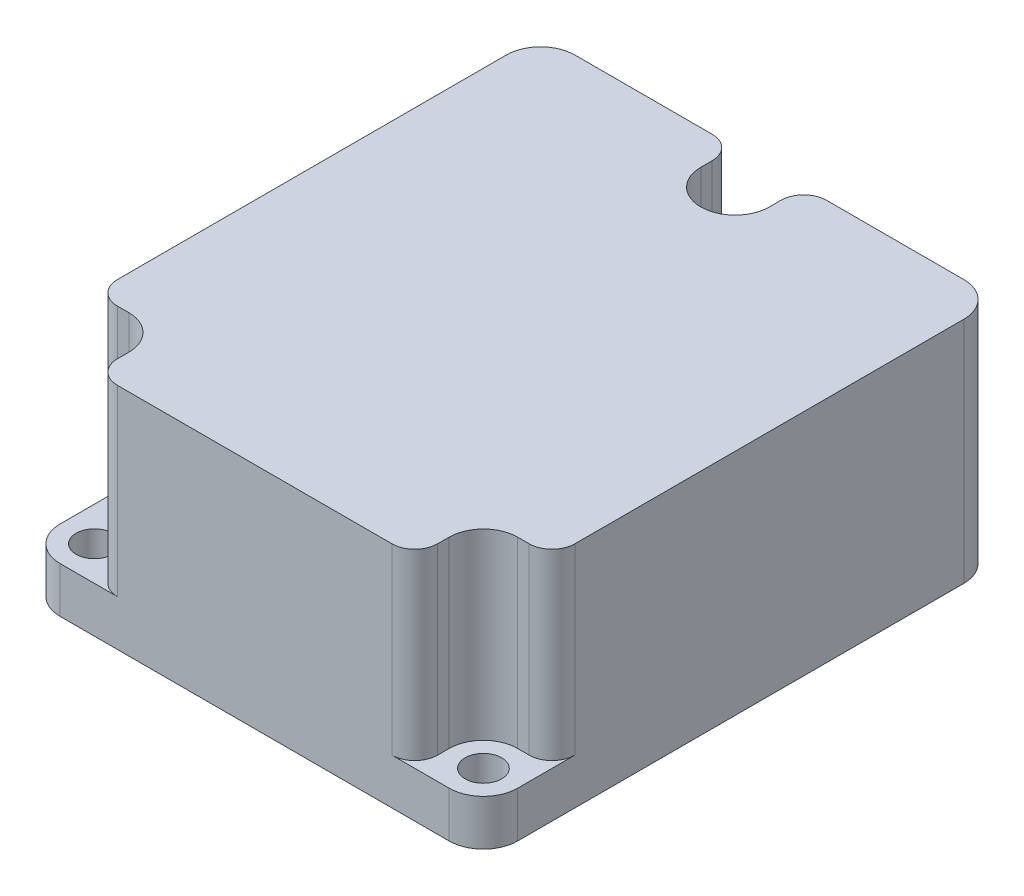
ISO-10303-21;
HEADER;
FILE_DESCRIPTION(('STEP AP214'),'2;1');
FILE_NAME('part.step','',(''),(''),'','','');
FILE_SCHEMA(('AUTOMOTIVE_DESIGN { 1 0 10303 214 1 1 1 1 }'));
ENDSEC;
DATA;
#1=APPLICATION_CONTEXT('core data for automotive mechanical design processes');
#2=APPLICATION_PROTOCOL_DEFINITION('international standard','automotive_design',2000,#1);
#3=PRODUCT_CONTEXT('',#1,'mechanical');
#4=PRODUCT('Part','Part','',(#3));
#5=PRODUCT_RELATED_PRODUCT_CATEGORY('part','',(#4));
#6=PRODUCT_DEFINITION_FORMATION('','',#4);
#7=PRODUCT_DEFINITION_CONTEXT('part definition',#1,'design');
#8=PRODUCT_DEFINITION('design','',#6,#7);
#9=PRODUCT_DEFINITION_SHAPE('','',#8);
#10=(LENGTH_UNIT() NAMED_UNIT(*) SI_UNIT(.MILLI.,.METRE.));
#11=(NAMED_UNIT(*) PLANE_ANGLE_UNIT() SI_UNIT($,.RADIAN.));
#12=(NAMED_UNIT(*) SI_UNIT($,.STERADIAN.) SOLID_ANGLE_UNIT());
#13=UNCERTAINTY_MEASURE_WITH_UNIT(LENGTH_MEASURE(1.E-05),#10,'distance_accuracy_value','');
#14=(GEOMETRIC_REPRESENTATION_CONTEXT(3) GLOBAL_UNCERTAINTY_ASSIGNED_CONTEXT((#13)) GLOBAL_UNIT_ASSIGNED_CONTEXT((#10,
#11,#12)) REPRESENTATION_CONTEXT('',''));
#15=CARTESIAN_POINT('',(0.,0.,0.));
#16=DIRECTION('',(0.,0.,1.));
#17=DIRECTION('',(1.,0.,0.));
#18=AXIS2_PLACEMENT_3D('',#15,#16,#17);
#19=CARTESIAN_POINT('',(3.00000000000001,20.,42.));
#20=DIRECTION('',(0.,1.,0.));
#21=DIRECTION('',(0.,0.,1.));
#22=AXIS2_PLACEMENT_3D('',#19,#20,#21);
#23=PLANE('',#22);
#24=DIRECTION('',(0.,0.,-1.));
#25=VECTOR('',#24,1.);
#26=CARTESIAN_POINT('',(17.,20.,0.));
#27=LINE('',#26,#25);
#28=CARTESIAN_POINT('',(17.,20.,3.));
#29=VERTEX_POINT('',#28);
#30=CARTESIAN_POINT('',(17.,20.,2.));
#31=VERTEX_POINT('',#30);
#32=EDGE_CURVE('E297',#29,#31,#27,.T.);
#33=ORIENTED_EDGE('',*,*,#32,.T.);
#34=CARTESIAN_POINT('',(15.,20.,2.));
#35=DIRECTION('',(0.,1.,0.));
#36=DIRECTION('',(0.,0.,1.));
#37=AXIS2_PLACEMENT_3D('',#34,#35,#36);
#38=CIRCLE('',#37,2.);
#39=CARTESIAN_POINT('',(15.,20.,0.));
#40=VERTEX_POINT('',#39);
#41=EDGE_CURVE('E384',#31,#40,#38,.T.);
#42=ORIENTED_EDGE('',*,*,#41,.T.);
#43=DIRECTION('',(-1.,0.,0.));
#44=VECTOR('',#43,1.);
#45=CARTESIAN_POINT('',(3.00000000000002,20.,0.));
#46=LINE('',#45,#44);
#47=CARTESIAN_POINT('',(3.00000000000002,20.,0.));
#48=VERTEX_POINT('',#47);
#49=EDGE_CURVE('E324',#40,#48,#46,.T.);
#50=ORIENTED_EDGE('',*,*,#49,.T.);
#51=CARTESIAN_POINT('',(3.,20.,3.));
#52=DIRECTION('',(0.,1.,0.));
#53=DIRECTION('',(0.,0.,1.));
#54=AXIS2_PLACEMENT_3D('',#51,#52,#53);
#55=CIRCLE('',#54,3.);
#56=CARTESIAN_POINT('',(0.,20.,3.00000000000002));
#57=VERTEX_POINT('',#56);
#58=EDGE_CURVE('E328',#48,#57,#55,.T.);
#59=ORIENTED_EDGE('',*,*,#58,.T.);
#60=DIRECTION('',(0.,0.,1.));
#61=VECTOR('',#60,1.);
#62=CARTESIAN_POINT('',(0.,20.,3.00000000000002));
#63=LINE('',#62,#61);
#64=CARTESIAN_POINT('',(0.,20.,37.));
#65=VERTEX_POINT('',#64);
#66=EDGE_CURVE('E330',#57,#65,#63,.T.);
#67=ORIENTED_EDGE('',*,*,#66,.T.);
#68=CARTESIAN_POINT('',(2.,20.,37.));
#69=DIRECTION('',(0.,1.,0.));
#70=DIRECTION('',(0.,0.,1.));
#71=AXIS2_PLACEMENT_3D('',#68,#69,#70);
#72=CIRCLE('',#71,2.);
#73=CARTESIAN_POINT('',(2.,20.,39.));
#74=VERTEX_POINT('',#73);
#75=EDGE_CURVE('E378',#65,#74,#72,.T.);
#76=ORIENTED_EDGE('',*,*,#75,.T.);
#77=DIRECTION('',(-1.,0.,0.));
#78=VECTOR('',#77,1.);
#79=CARTESIAN_POINT('',(0.,20.,39.));
#80=LINE('',#79,#78);
#81=CARTESIAN_POINT('',(3.00000000000001,20.,39.));
#82=VERTEX_POINT('',#81);
#83=EDGE_CURVE('E254',#82,#74,#80,.T.);
#84=ORIENTED_EDGE('',*,*,#83,.F.);
#85=CARTESIAN_POINT('',(3.00000000000001,20.,42.));
#86=DIRECTION('',(0.,1.,0.));
#87=DIRECTION('',(0.,0.,1.));
#88=AXIS2_PLACEMENT_3D('',#85,#86,#87);
#89=CIRCLE('',#88,3.);
#90=CARTESIAN_POINT('',(6.00000000000001,20.,42.));
#91=VERTEX_POINT('',#90);
#92=EDGE_CURVE('E273',#91,#82,#89,.T.);
#93=ORIENTED_EDGE('',*,*,#92,.F.);
#94=DIRECTION('',(0.,0.,1.));
#95=VECTOR('',#94,1.);
#96=CARTESIAN_POINT('',(6.00000000000001,20.,0.));
#97=LINE('',#96,#95);
#98=CARTESIAN_POINT('',(6.00000000000001,20.,43.));
#99=VERTEX_POINT('',#98);
#100=EDGE_CURVE('E270',#91,#99,#97,.T.);
#101=ORIENTED_EDGE('',*,*,#100,.T.);
#102=CARTESIAN_POINT('',(8.00000000000001,20.,43.));
#103=DIRECTION('',(0.,1.,0.));
#104=DIRECTION('',(0.,0.,1.));
#105=AXIS2_PLACEMENT_3D('',#102,#103,#104);
#106=CIRCLE('',#105,2.);
#107=CARTESIAN_POINT('',(8.00000000000001,20.,45.));
#108=VERTEX_POINT('',#107);
#109=EDGE_CURVE('E380',#99,#108,#106,.T.);
#110=ORIENTED_EDGE('',*,*,#109,.T.);
#111=DIRECTION('',(1.,0.,0.));
#112=VECTOR('',#111,1.);
#113=CARTESIAN_POINT('',(3.00000000000003,20.,45.));
#114=LINE('',#113,#112);
#115=CARTESIAN_POINT('',(32.,20.,45.));
#116=VERTEX_POINT('',#115);
#117=EDGE_CURVE('E316',#108,#116,#114,.T.);
#118=ORIENTED_EDGE('',*,*,#117,.T.);
#119=CARTESIAN_POINT('',(32.,20.,43.));
#120=DIRECTION('',(0.,1.,0.));
#121=DIRECTION('',(0.,0.,1.));
#122=AXIS2_PLACEMENT_3D('',#119,#120,#121);
#123=CIRCLE('',#122,2.);
#124=CARTESIAN_POINT('',(34.,20.,43.));
#125=VERTEX_POINT('',#124);
#126=EDGE_CURVE('E376',#116,#125,#123,.T.);
#127=ORIENTED_EDGE('',*,*,#126,.T.);
#128=DIRECTION('',(0.,0.,1.));
#129=VECTOR('',#128,1.);
#130=CARTESIAN_POINT('',(34.,20.,0.));
#131=LINE('',#130,#129);
#132=CARTESIAN_POINT('',(34.,20.,42.));
#133=VERTEX_POINT('',#132);
#134=EDGE_CURVE('E245',#133,#125,#131,.T.);
#135=ORIENTED_EDGE('',*,*,#134,.F.);
#136=CARTESIAN_POINT('',(37.,20.,42.));
#137=DIRECTION('',(0.,1.,0.));
#138=DIRECTION('',(0.,0.,1.));
#139=AXIS2_PLACEMENT_3D('',#136,#137,#138);
#140=CIRCLE('',#139,3.);
#141=CARTESIAN_POINT('',(37.,20.,39.));
#142=VERTEX_POINT('',#141);
#143=EDGE_CURVE('E242',#142,#133,#140,.T.);
#144=ORIENTED_EDGE('',*,*,#143,.F.);
#145=DIRECTION('',(1.,0.,0.));
#146=VECTOR('',#145,1.);
#147=CARTESIAN_POINT('',(0.,20.,39.));
#148=LINE('',#147,#146);
#149=CARTESIAN_POINT('',(38.,20.,39.));
#150=VERTEX_POINT('',#149);
#151=EDGE_CURVE('E216',#142,#150,#148,.T.);
#152=ORIENTED_EDGE('',*,*,#151,.T.);
#153=CARTESIAN_POINT('',(38.,20.,37.));
#154=DIRECTION('',(0.,1.,0.));
#155=DIRECTION('',(0.,0.,1.));
#156=AXIS2_PLACEMENT_3D('',#153,#154,#155);
#157=CIRCLE('',#156,2.);
#158=CARTESIAN_POINT('',(40.,20.,37.));
#159=VERTEX_POINT('',#158);
#160=EDGE_CURVE('E374',#150,#159,#157,.T.);
#161=ORIENTED_EDGE('',*,*,#160,.T.);
#162=DIRECTION('',(0.,0.,-1.));
#163=VECTOR('',#162,1.);
#164=CARTESIAN_POINT('',(40.,20.,3.00000000000002));
#165=LINE('',#164,#163);
#166=CARTESIAN_POINT('',(40.,20.,3.00000000000002));
#167=VERTEX_POINT('',#166);
#168=EDGE_CURVE('E319',#159,#167,#165,.T.);
#169=ORIENTED_EDGE('',*,*,#168,.T.);
#170=CARTESIAN_POINT('',(37.,20.,3.));
#171=DIRECTION('',(0.,1.,0.));
#172=DIRECTION('',(0.,0.,-1.));
#173=AXIS2_PLACEMENT_3D('',#170,#171,#172);
#174=CIRCLE('',#173,3.);
#175=CARTESIAN_POINT('',(37.,20.,0.));
#176=VERTEX_POINT('',#175);
#177=EDGE_CURVE('E322',#167,#176,#174,.T.);
#178=ORIENTED_EDGE('',*,*,#177,.T.);
#179=CARTESIAN_POINT('',(25.,20.,0.));
#180=VERTEX_POINT('',#179);
#181=EDGE_CURVE('E325',#176,#180,#46,.T.);
#182=ORIENTED_EDGE('',*,*,#181,.T.);
#183=CARTESIAN_POINT('',(25.,20.,2.));
#184=DIRECTION('',(0.,1.,0.));
#185=DIRECTION('',(0.,0.,1.));
#186=AXIS2_PLACEMENT_3D('',#183,#184,#185);
#187=CIRCLE('',#186,2.);
#188=CARTESIAN_POINT('',(23.,20.,2.));
#189=VERTEX_POINT('',#188);
#190=EDGE_CURVE('E382',#180,#189,#187,.T.);
#191=ORIENTED_EDGE('',*,*,#190,.T.);
#192=DIRECTION('',(0.,0.,-1.));
#193=VECTOR('',#192,1.);
#194=CARTESIAN_POINT('',(23.,20.,0.));
#195=LINE('',#194,#193);
#196=CARTESIAN_POINT('',(23.,20.,3.));
#197=VERTEX_POINT('',#196);
#198=EDGE_CURVE('E285',#197,#189,#195,.T.);
#199=ORIENTED_EDGE('',*,*,#198,.F.);
#200=CARTESIAN_POINT('',(20.,20.,3.));
#201=DIRECTION('',(0.,1.,0.));
#202=DIRECTION('',(0.,0.,1.));
#203=AXIS2_PLACEMENT_3D('',#200,#201,#202);
#204=CIRCLE('',#203,3.);
#205=EDGE_CURVE('E300',#29,#197,#204,.T.);
#206=ORIENTED_EDGE('',*,*,#205,.F.);
#207=EDGE_LOOP('',(#33,#42,#50,#59,#67,#76,#84,#93,#101,#110,#118,#127,#135,#144,#152,#161,#169,
#178,#182,#191,#199,#206));
#208=FACE_BOUND('',#207,.T.);
#209=ADVANCED_FACE('F40',(#208),#23,.T.);
#210=CARTESIAN_POINT('',(3.00000000000001,20.,42.));
#211=DIRECTION('',(0.,-1.,0.));
#212=DIRECTION('',(0.,0.,-1.));
#213=AXIS2_PLACEMENT_3D('',#210,#211,#212);
#214=CYLINDRICAL_SURFACE('',#213,3.);
#215=CARTESIAN_POINT('',(3.00000000000001,4.,42.));
#216=DIRECTION('',(0.,1.,0.));
#217=DIRECTION('',(0.,0.,1.));
#218=AXIS2_PLACEMENT_3D('',#215,#216,#217);
#219=CIRCLE('',#218,3.);
#220=CARTESIAN_POINT('',(0.,4.,42.));
#221=VERTEX_POINT('',#220);
#222=CARTESIAN_POINT('',(3.00000000000003,4.,45.));
#223=VERTEX_POINT('',#222);
#224=EDGE_CURVE('E265',#221,#223,#219,.T.);
#225=ORIENTED_EDGE('',*,*,#224,.F.);
#226=DIRECTION('',(0.,-1.,0.));
#227=VECTOR('',#226,1.);
#228=CARTESIAN_POINT('',(0.,20.,42.));
#229=LINE('',#228,#227);
#230=CARTESIAN_POINT('',(0.,0.,42.));
#231=VERTEX_POINT('',#230);
#232=EDGE_CURVE('E333',#221,#231,#229,.T.);
#233=ORIENTED_EDGE('',*,*,#232,.T.);
#234=CARTESIAN_POINT('',(3.00000000000001,0.,42.));
#235=DIRECTION('',(0.,1.,0.));
#236=DIRECTION('',(0.,0.,1.));
#237=AXIS2_PLACEMENT_3D('',#234,#235,#236);
#238=CIRCLE('',#237,3.);
#239=CARTESIAN_POINT('',(3.00000000000003,0.,45.));
#240=VERTEX_POINT('',#239);
#241=EDGE_CURVE('E315',#231,#240,#238,.T.);
#242=ORIENTED_EDGE('',*,*,#241,.T.);
#243=DIRECTION('',(0.,-1.,0.));
#244=VECTOR('',#243,1.);
#245=CARTESIAN_POINT('',(3.00000000000003,20.,45.));
#246=LINE('',#245,#244);
#247=EDGE_CURVE('E369',#223,#240,#246,.T.);
#248=ORIENTED_EDGE('',*,*,#247,.F.);
#249=EDGE_LOOP('',(#225,#233,#242,#248));
#250=FACE_BOUND('',#249,.T.);
#251=ADVANCED_FACE('F482',(#250),#214,.T.);
#252=CARTESIAN_POINT('',(3.00000000000003,20.,45.));
#253=DIRECTION('',(0.,0.,-1.));
#254=DIRECTION('',(-1.,0.,0.));
#255=AXIS2_PLACEMENT_3D('',#252,#253,#254);
#256=PLANE('',#255);
#257=ORIENTED_EDGE('',*,*,#117,.F.);
#258=DIRECTION('',(0.,1.,0.));
#259=VECTOR('',#258,1.);
#260=CARTESIAN_POINT('',(8.00000000000001,4.,45.));
#261=LINE('',#260,#259);
#262=CARTESIAN_POINT('',(8.00000000000001,4.,45.));
#263=VERTEX_POINT('',#262);
#264=EDGE_CURVE('E400',#108,#263,#261,.F.);
#265=ORIENTED_EDGE('',*,*,#264,.T.);
#266=DIRECTION('',(1.,0.,0.));
#267=VECTOR('',#266,1.);
#268=CARTESIAN_POINT('',(0.,4.,45.));
#269=LINE('',#268,#267);
#270=EDGE_CURVE('E267',#223,#263,#269,.T.);
#271=ORIENTED_EDGE('',*,*,#270,.F.);
#272=ORIENTED_EDGE('',*,*,#247,.T.);
#273=DIRECTION('',(1.,0.,0.));
#274=VECTOR('',#273,1.);
#275=CARTESIAN_POINT('',(3.00000000000003,0.,45.));
#276=LINE('',#275,#274);
#277=CARTESIAN_POINT('',(37.,0.,45.));
#278=VERTEX_POINT('',#277);
#279=EDGE_CURVE('E336',#240,#278,#276,.T.);
#280=ORIENTED_EDGE('',*,*,#279,.T.);
#281=DIRECTION('',(0.,-1.,0.));
#282=VECTOR('',#281,1.);
#283=CARTESIAN_POINT('',(37.,20.,45.));
#284=LINE('',#283,#282);
#285=CARTESIAN_POINT('',(37.,4.,45.));
#286=VERTEX_POINT('',#285);
#287=EDGE_CURVE('E367',#286,#278,#284,.T.);
#288=ORIENTED_EDGE('',*,*,#287,.F.);
#289=DIRECTION('',(1.,0.,0.));
#290=VECTOR('',#289,1.);
#291=CARTESIAN_POINT('',(0.,4.,45.));
#292=LINE('',#291,#290);
#293=CARTESIAN_POINT('',(32.,4.,45.));
#294=VERTEX_POINT('',#293);
#295=EDGE_CURVE('E233',#294,#286,#292,.T.);
#296=ORIENTED_EDGE('',*,*,#295,.F.);
#297=DIRECTION('',(0.,1.,0.));
#298=VECTOR('',#297,1.);
#299=CARTESIAN_POINT('',(32.,20.,45.));
#300=LINE('',#299,#298);
#301=EDGE_CURVE('E397',#294,#116,#300,.T.);
#302=ORIENTED_EDGE('',*,*,#301,.T.);
#303=EDGE_LOOP('',(#257,#265,#271,#272,#280,#288,#296,#302));
#304=FACE_BOUND('',#303,.T.);
#305=ADVANCED_FACE('F432',(#304),#256,.F.);
#306=CARTESIAN_POINT('',(37.,20.,42.));
#307=DIRECTION('',(0.,-1.,0.));
#308=DIRECTION('',(0.,0.,-1.));
#309=AXIS2_PLACEMENT_3D('',#306,#307,#308);
#310=CYLINDRICAL_SURFACE('',#309,3.);
#311=CARTESIAN_POINT('',(37.,4.,42.));
#312=DIRECTION('',(0.,1.,0.));
#313=DIRECTION('',(0.,0.,1.));
#314=AXIS2_PLACEMENT_3D('',#311,#312,#313);
#315=CIRCLE('',#314,3.);
#316=CARTESIAN_POINT('',(40.,4.,42.));
#317=VERTEX_POINT('',#316);
#318=EDGE_CURVE('E238',#286,#317,#315,.T.);
#319=ORIENTED_EDGE('',*,*,#318,.F.);
#320=ORIENTED_EDGE('',*,*,#287,.T.);
#321=CARTESIAN_POINT('',(37.,0.,42.));
#322=DIRECTION('',(0.,1.,0.));
#323=DIRECTION('',(0.,0.,1.));
#324=AXIS2_PLACEMENT_3D('',#321,#322,#323);
#325=CIRCLE('',#324,3.);
#326=CARTESIAN_POINT('',(40.,0.,42.));
#327=VERTEX_POINT('',#326);
#328=EDGE_CURVE('E339',#278,#327,#325,.T.);
#329=ORIENTED_EDGE('',*,*,#328,.T.);
#330=DIRECTION('',(0.,-1.,0.));
#331=VECTOR('',#330,1.);
#332=CARTESIAN_POINT('',(40.,20.,42.));
#333=LINE('',#332,#331);
#334=EDGE_CURVE('E365',#317,#327,#333,.T.);
#335=ORIENTED_EDGE('',*,*,#334,.F.);
#336=EDGE_LOOP('',(#319,#320,#329,#335));
#337=FACE_BOUND('',#336,.T.);
#338=ADVANCED_FACE('F488',(#337),#310,.T.);
#339=CARTESIAN_POINT('',(40.,20.,3.00000000000002));
#340=DIRECTION('',(-1.,0.,0.));
#341=DIRECTION('',(0.,0.,1.));
#342=AXIS2_PLACEMENT_3D('',#339,#340,#341);
#343=PLANE('',#342);
#344=ORIENTED_EDGE('',*,*,#168,.F.);
#345=DIRECTION('',(0.,1.,0.));
#346=VECTOR('',#345,1.);
#347=CARTESIAN_POINT('',(40.,4.,37.));
#348=LINE('',#347,#346);
#349=CARTESIAN_POINT('',(40.,4.,37.));
#350=VERTEX_POINT('',#349);
#351=EDGE_CURVE('E412',#159,#350,#348,.F.);
#352=ORIENTED_EDGE('',*,*,#351,.T.);
#353=DIRECTION('',(0.,0.,-1.));
#354=VECTOR('',#353,1.);
#355=CARTESIAN_POINT('',(40.,4.,0.));
#356=LINE('',#355,#354);
#357=EDGE_CURVE('E54',#317,#350,#356,.T.);
#358=ORIENTED_EDGE('',*,*,#357,.F.);
#359=ORIENTED_EDGE('',*,*,#334,.T.);
#360=DIRECTION('',(0.,0.,-1.));
#361=VECTOR('',#360,1.);
#362=CARTESIAN_POINT('',(40.,0.,3.00000000000002));
#363=LINE('',#362,#361);
#364=CARTESIAN_POINT('',(40.,0.,3.00000000000002));
#365=VERTEX_POINT('',#364);
#366=EDGE_CURVE('E342',#327,#365,#363,.T.);
#367=ORIENTED_EDGE('',*,*,#366,.T.);
#368=DIRECTION('',(0.,-1.,0.));
#369=VECTOR('',#368,1.);
#370=CARTESIAN_POINT('',(40.,20.,3.00000000000002));
#371=LINE('',#370,#369);
#372=EDGE_CURVE('E362',#167,#365,#371,.T.);
#373=ORIENTED_EDGE('',*,*,#372,.F.);
#374=EDGE_LOOP('',(#344,#352,#358,#359,#367,#373));
#375=FACE_BOUND('',#374,.T.);
#376=ADVANCED_FACE('F491',(#375),#343,.F.);
#377=CARTESIAN_POINT('',(3.00000000000002,20.,0.));
#378=DIRECTION('',(0.,0.,1.));
#379=DIRECTION('',(1.,0.,0.));
#380=AXIS2_PLACEMENT_3D('',#377,#378,#379);
#381=PLANE('',#380);
#382=ORIENTED_EDGE('',*,*,#49,.F.);
#383=DIRECTION('',(0.,1.,0.));
#384=VECTOR('',#383,1.);
#385=CARTESIAN_POINT('',(15.,4.,0.));
#386=LINE('',#385,#384);
#387=CARTESIAN_POINT('',(15.,4.,0.));
#388=VERTEX_POINT('',#387);
#389=EDGE_CURVE('E389',#40,#388,#386,.F.);
#390=ORIENTED_EDGE('',*,*,#389,.T.);
#391=DIRECTION('',(-1.,0.,0.));
#392=VECTOR('',#391,1.);
#393=CARTESIAN_POINT('',(0.,4.,0.));
#394=LINE('',#393,#392);
#395=CARTESIAN_POINT('',(25.,4.,0.));
#396=VERTEX_POINT('',#395);
#397=EDGE_CURVE('E294',#396,#388,#394,.T.);
#398=ORIENTED_EDGE('',*,*,#397,.F.);
#399=DIRECTION('',(0.,1.,0.));
#400=VECTOR('',#399,1.);
#401=CARTESIAN_POINT('',(25.,20.,0.));
#402=LINE('',#401,#400);
#403=EDGE_CURVE('E386',#396,#180,#402,.T.);
#404=ORIENTED_EDGE('',*,*,#403,.T.);
#405=ORIENTED_EDGE('',*,*,#181,.F.);
#406=DIRECTION('',(0.,-1.,0.));
#407=VECTOR('',#406,1.);
#408=CARTESIAN_POINT('',(37.,20.,0.));
#409=LINE('',#408,#407);
#410=CARTESIAN_POINT('',(37.,0.,0.));
#411=VERTEX_POINT('',#410);
#412=EDGE_CURVE('E359',#176,#411,#409,.T.);
#413=ORIENTED_EDGE('',*,*,#412,.T.);
#414=DIRECTION('',(-1.,0.,0.));
#415=VECTOR('',#414,1.);
#416=CARTESIAN_POINT('',(3.00000000000002,0.,0.));
#417=LINE('',#416,#415);
#418=CARTESIAN_POINT('',(3.00000000000002,0.,0.));
#419=VERTEX_POINT('',#418);
#420=EDGE_CURVE('E346',#411,#419,#417,.T.);
#421=ORIENTED_EDGE('',*,*,#420,.T.);
#422=DIRECTION('',(0.,-1.,0.));
#423=VECTOR('',#422,1.);
#424=CARTESIAN_POINT('',(3.00000000000002,20.,0.));
#425=LINE('',#424,#423);
#426=EDGE_CURVE('E356',#48,#419,#425,.T.);
#427=ORIENTED_EDGE('',*,*,#426,.F.);
#428=EDGE_LOOP('',(#382,#390,#398,#404,#405,#413,#421,#427));
#429=FACE_BOUND('',#428,.T.);
#430=ADVANCED_FACE('F524',(#429),#381,.F.);
#431=CARTESIAN_POINT('',(20.,20.,3.));
#432=DIRECTION('',(0.,-1.,0.));
#433=DIRECTION('',(0.,0.,-1.));
#434=AXIS2_PLACEMENT_3D('',#431,#432,#433);
#435=CYLINDRICAL_SURFACE('',#434,1.6);
#436=CARTESIAN_POINT('',(20.,0.,3.));
#437=DIRECTION('',(0.,1.,0.));
#438=DIRECTION('',(0.,0.,1.));
#439=AXIS2_PLACEMENT_3D('',#436,#437,#438);
#440=CIRCLE('',#439,1.6);
#441=CARTESIAN_POINT('',(20.,0.,4.6));
#442=VERTEX_POINT('',#441);
#443=EDGE_CURVE('E312',#442,#442,#440,.T.);
#444=ORIENTED_EDGE('',*,*,#443,.F.);
#445=EDGE_LOOP('',(#444));
#446=FACE_BOUND('',#445,.T.);
#447=CARTESIAN_POINT('',(20.,4.,3.));
#448=DIRECTION('',(0.,1.,0.));
#449=DIRECTION('',(0.,0.,1.));
#450=AXIS2_PLACEMENT_3D('',#447,#448,#449);
#451=CIRCLE('',#450,1.6);
#452=CARTESIAN_POINT('',(20.,4.,4.6));
#453=VERTEX_POINT('',#452);
#454=EDGE_CURVE('E281',#453,#453,#451,.F.);
#455=ORIENTED_EDGE('',*,*,#454,.F.);
#456=EDGE_LOOP('',(#455));
#457=FACE_BOUND('',#456,.T.);
#458=ADVANCED_FACE('F514',(#446,#457),#435,.F.);
#459=CARTESIAN_POINT('',(3.00000000000001,20.,42.));
#460=DIRECTION('',(0.,-1.,0.));
#461=DIRECTION('',(0.,0.,-1.));
#462=AXIS2_PLACEMENT_3D('',#459,#460,#461);
#463=CYLINDRICAL_SURFACE('',#462,1.6);
#464=CARTESIAN_POINT('',(3.00000000000001,0.,42.));
#465=DIRECTION('',(0.,1.,0.));
#466=DIRECTION('',(0.,0.,1.));
#467=AXIS2_PLACEMENT_3D('',#464,#465,#466);
#468=CIRCLE('',#467,1.6);
#469=CARTESIAN_POINT('',(3.00000000000001,0.,43.6));
#470=VERTEX_POINT('',#469);
#471=EDGE_CURVE('E309',#470,#470,#468,.T.);
#472=ORIENTED_EDGE('',*,*,#471,.F.);
#473=EDGE_LOOP('',(#472));
#474=FACE_BOUND('',#473,.T.);
#475=CARTESIAN_POINT('',(3.00000000000001,4.,42.));
#476=DIRECTION('',(0.,1.,0.));
#477=DIRECTION('',(0.,0.,1.));
#478=AXIS2_PLACEMENT_3D('',#475,#476,#477);
#479=CIRCLE('',#478,1.6);
#480=CARTESIAN_POINT('',(3.00000000000001,4.,43.6));
#481=VERTEX_POINT('',#480);
#482=EDGE_CURVE('E250',#481,#481,#479,.F.);
#483=ORIENTED_EDGE('',*,*,#482,.F.);
#484=EDGE_LOOP('',(#483));
#485=FACE_BOUND('',#484,.T.);
#486=ADVANCED_FACE('F588',(#474,#485),#463,.F.);
#487=CARTESIAN_POINT('',(37.,20.,42.));
#488=DIRECTION('',(0.,-1.,0.));
#489=DIRECTION('',(0.,0.,-1.));
#490=AXIS2_PLACEMENT_3D('',#487,#488,#489);
#491=CYLINDRICAL_SURFACE('',#490,1.6);
#492=CARTESIAN_POINT('',(37.,0.,42.));
#493=DIRECTION('',(0.,1.,0.));
#494=DIRECTION('',(0.,0.,1.));
#495=AXIS2_PLACEMENT_3D('',#492,#493,#494);
#496=CIRCLE('',#495,1.6);
#497=CARTESIAN_POINT('',(37.,0.,43.6));
#498=VERTEX_POINT('',#497);
#499=EDGE_CURVE('E248',#498,#498,#496,.T.);
#500=ORIENTED_EDGE('',*,*,#499,.F.);
#501=EDGE_LOOP('',(#500));
#502=FACE_BOUND('',#501,.T.);
#503=CARTESIAN_POINT('',(37.,4.,42.));
#504=DIRECTION('',(0.,1.,0.));
#505=DIRECTION('',(0.,0.,1.));
#506=AXIS2_PLACEMENT_3D('',#503,#504,#505);
#507=CIRCLE('',#506,1.6);
#508=CARTESIAN_POINT('',(37.,4.,43.6));
#509=VERTEX_POINT('',#508);
#510=EDGE_CURVE('E227',#509,#509,#507,.F.);
#511=ORIENTED_EDGE('',*,*,#510,.F.);
#512=EDGE_LOOP('',(#511));
#513=FACE_BOUND('',#512,.T.);
#514=ADVANCED_FACE('F519',(#502,#513),#491,.F.);
#515=CARTESIAN_POINT('',(3.00000000000001,0.,42.));
#516=DIRECTION('',(0.,1.,0.));
#517=DIRECTION('',(0.,0.,1.));
#518=AXIS2_PLACEMENT_3D('',#515,#516,#517);
#519=PLANE('',#518);
#520=ORIENTED_EDGE('',*,*,#241,.F.);
#521=DIRECTION('',(0.,0.,1.));
#522=VECTOR('',#521,1.);
#523=CARTESIAN_POINT('',(0.,0.,3.00000000000002));
#524=LINE('',#523,#522);
#525=CARTESIAN_POINT('',(0.,0.,3.00000000000002));
#526=VERTEX_POINT('',#525);
#527=EDGE_CURVE('E320',#526,#231,#524,.T.);
#528=ORIENTED_EDGE('',*,*,#527,.F.);
#529=CARTESIAN_POINT('',(3.,0.,3.));
#530=DIRECTION('',(0.,1.,0.));
#531=DIRECTION('',(0.,0.,1.));
#532=AXIS2_PLACEMENT_3D('',#529,#530,#531);
#533=CIRCLE('',#532,3.);
#534=EDGE_CURVE('E348',#419,#526,#533,.T.);
#535=ORIENTED_EDGE('',*,*,#534,.F.);
#536=ORIENTED_EDGE('',*,*,#420,.F.);
#537=CARTESIAN_POINT('',(37.,0.,3.));
#538=DIRECTION('',(0.,1.,0.));
#539=DIRECTION('',(0.,0.,-1.));
#540=AXIS2_PLACEMENT_3D('',#537,#538,#539);
#541=CIRCLE('',#540,3.);
#542=EDGE_CURVE('E344',#365,#411,#541,.T.);
#543=ORIENTED_EDGE('',*,*,#542,.F.);
#544=ORIENTED_EDGE('',*,*,#366,.F.);
#545=ORIENTED_EDGE('',*,*,#328,.F.);
#546=ORIENTED_EDGE('',*,*,#279,.F.);
#547=EDGE_LOOP('',(#520,#528,#535,#536,#543,#544,#545,#546));
#548=FACE_BOUND('',#547,.T.);
#549=ORIENTED_EDGE('',*,*,#443,.T.);
#550=EDGE_LOOP('',(#549));
#551=FACE_BOUND('',#550,.T.);
#552=ORIENTED_EDGE('',*,*,#471,.T.);
#553=EDGE_LOOP('',(#552));
#554=FACE_BOUND('',#553,.T.);
#555=ORIENTED_EDGE('',*,*,#499,.T.);
#556=EDGE_LOOP('',(#555));
#557=FACE_BOUND('',#556,.T.);
#558=ADVANCED_FACE('F474',(#548,#551,#554,#557),#519,.F.);
#559=CARTESIAN_POINT('',(37.,20.,3.));
#560=DIRECTION('',(0.,-1.,0.));
#561=DIRECTION('',(0.,0.,-1.));
#562=AXIS2_PLACEMENT_3D('',#559,#560,#561);
#563=CYLINDRICAL_SURFACE('',#562,3.);
#564=ORIENTED_EDGE('',*,*,#542,.T.);
#565=ORIENTED_EDGE('',*,*,#412,.F.);
#566=ORIENTED_EDGE('',*,*,#177,.F.);
#567=ORIENTED_EDGE('',*,*,#372,.T.);
#568=EDGE_LOOP('',(#564,#565,#566,#567));
#569=FACE_BOUND('',#568,.T.);
#570=ADVANCED_FACE('F518',(#569),#563,.T.);
#571=CARTESIAN_POINT('',(3.,20.,3.));
#572=DIRECTION('',(0.,-1.,0.));
#573=DIRECTION('',(0.,0.,-1.));
#574=AXIS2_PLACEMENT_3D('',#571,#572,#573);
#575=CYLINDRICAL_SURFACE('',#574,3.);
#576=ORIENTED_EDGE('',*,*,#534,.T.);
#577=DIRECTION('',(0.,-1.,0.));
#578=VECTOR('',#577,1.);
#579=CARTESIAN_POINT('',(0.,20.,3.00000000000002));
#580=LINE('',#579,#578);
#581=EDGE_CURVE('E353',#57,#526,#580,.T.);
#582=ORIENTED_EDGE('',*,*,#581,.F.);
#583=ORIENTED_EDGE('',*,*,#58,.F.);
#584=ORIENTED_EDGE('',*,*,#426,.T.);
#585=EDGE_LOOP('',(#576,#582,#583,#584));
#586=FACE_BOUND('',#585,.T.);
#587=ADVANCED_FACE('F469',(#586),#575,.T.);
#588=CARTESIAN_POINT('',(0.,20.,3.00000000000002));
#589=DIRECTION('',(1.,0.,0.));
#590=DIRECTION('',(0.,0.,-1.));
#591=AXIS2_PLACEMENT_3D('',#588,#589,#590);
#592=PLANE('',#591);
#593=DIRECTION('',(0.,0.,1.));
#594=VECTOR('',#593,1.);
#595=CARTESIAN_POINT('',(0.,4.,0.));
#596=LINE('',#595,#594);
#597=CARTESIAN_POINT('',(0.,4.,37.));
#598=VERTEX_POINT('',#597);
#599=EDGE_CURVE('E263',#598,#221,#596,.T.);
#600=ORIENTED_EDGE('',*,*,#599,.F.);
#601=DIRECTION('',(0.,1.,0.));
#602=VECTOR('',#601,1.);
#603=CARTESIAN_POINT('',(0.,20.,37.));
#604=LINE('',#603,#602);
#605=EDGE_CURVE('E403',#598,#65,#604,.T.);
#606=ORIENTED_EDGE('',*,*,#605,.T.);
#607=ORIENTED_EDGE('',*,*,#66,.F.);
#608=ORIENTED_EDGE('',*,*,#581,.T.);
#609=ORIENTED_EDGE('',*,*,#527,.T.);
#610=ORIENTED_EDGE('',*,*,#232,.F.);
#611=EDGE_LOOP('',(#600,#606,#607,#608,#609,#610));
#612=FACE_BOUND('',#611,.T.);
#613=ADVANCED_FACE('F462',(#612),#592,.F.);
#614=CARTESIAN_POINT('',(0.,4.,39.));
#615=DIRECTION('',(0.,0.,1.));
#616=DIRECTION('',(1.,0.,0.));
#617=AXIS2_PLACEMENT_3D('',#614,#615,#616);
#618=PLANE('',#617);
#619=DIRECTION('',(1.,0.,0.));
#620=VECTOR('',#619,1.);
#621=CARTESIAN_POINT('',(0.,4.,39.));
#622=LINE('',#621,#620);
#623=CARTESIAN_POINT('',(37.,4.,39.));
#624=VERTEX_POINT('',#623);
#625=CARTESIAN_POINT('',(38.,4.,39.));
#626=VERTEX_POINT('',#625);
#627=EDGE_CURVE('E213',#624,#626,#622,.T.);
#628=ORIENTED_EDGE('',*,*,#627,.T.);
#629=DIRECTION('',(0.,1.,0.));
#630=VECTOR('',#629,1.);
#631=CARTESIAN_POINT('',(38.,20.,39.));
#632=LINE('',#631,#630);
#633=EDGE_CURVE('E410',#626,#150,#632,.T.);
#634=ORIENTED_EDGE('',*,*,#633,.T.);
#635=ORIENTED_EDGE('',*,*,#151,.F.);
#636=DIRECTION('',(0.,1.,0.));
#637=VECTOR('',#636,1.);
#638=CARTESIAN_POINT('',(37.,4.,39.));
#639=LINE('',#638,#637);
#640=EDGE_CURVE('E210',#624,#142,#639,.T.);
#641=ORIENTED_EDGE('',*,*,#640,.F.);
#642=EDGE_LOOP('',(#628,#634,#635,#641));
#643=FACE_BOUND('',#642,.T.);
#644=ADVANCED_FACE('F211',(#643),#618,.T.);
#645=CARTESIAN_POINT('',(34.,4.,0.));
#646=DIRECTION('',(-1.,0.,0.));
#647=DIRECTION('',(0.,0.,1.));
#648=AXIS2_PLACEMENT_3D('',#645,#646,#647);
#649=PLANE('',#648);
#650=ORIENTED_EDGE('',*,*,#134,.T.);
#651=DIRECTION('',(0.,1.,0.));
#652=VECTOR('',#651,1.);
#653=CARTESIAN_POINT('',(34.,4.,43.));
#654=LINE('',#653,#652);
#655=CARTESIAN_POINT('',(34.,4.,43.));
#656=VERTEX_POINT('',#655);
#657=EDGE_CURVE('E408',#125,#656,#654,.F.);
#658=ORIENTED_EDGE('',*,*,#657,.T.);
#659=DIRECTION('',(0.,0.,1.));
#660=VECTOR('',#659,1.);
#661=CARTESIAN_POINT('',(34.,4.,0.));
#662=LINE('',#661,#660);
#663=CARTESIAN_POINT('',(34.,4.,42.));
#664=VERTEX_POINT('',#663);
#665=EDGE_CURVE('E231',#664,#656,#662,.T.);
#666=ORIENTED_EDGE('',*,*,#665,.F.);
#667=DIRECTION('',(0.,1.,0.));
#668=VECTOR('',#667,1.);
#669=CARTESIAN_POINT('',(34.,4.,42.));
#670=LINE('',#669,#668);
#671=EDGE_CURVE('E221',#664,#133,#670,.T.);
#672=ORIENTED_EDGE('',*,*,#671,.T.);
#673=EDGE_LOOP('',(#650,#658,#666,#672));
#674=FACE_BOUND('',#673,.T.);
#675=ADVANCED_FACE('F496',(#674),#649,.F.);
#676=CARTESIAN_POINT('',(37.,4.,42.));
#677=DIRECTION('',(0.,1.,0.));
#678=DIRECTION('',(0.,0.,1.));
#679=AXIS2_PLACEMENT_3D('',#676,#677,#678);
#680=CYLINDRICAL_SURFACE('',#679,3.);
#681=ORIENTED_EDGE('',*,*,#143,.T.);
#682=ORIENTED_EDGE('',*,*,#671,.F.);
#683=CARTESIAN_POINT('',(37.,4.,42.));
#684=DIRECTION('',(0.,1.,0.));
#685=DIRECTION('',(0.,0.,1.));
#686=AXIS2_PLACEMENT_3D('',#683,#684,#685);
#687=CIRCLE('',#686,3.);
#688=EDGE_CURVE('E226',#624,#664,#687,.T.);
#689=ORIENTED_EDGE('',*,*,#688,.F.);
#690=ORIENTED_EDGE('',*,*,#640,.T.);
#691=EDGE_LOOP('',(#681,#682,#689,#690));
#692=FACE_BOUND('',#691,.T.);
#693=ADVANCED_FACE('F229',(#692),#680,.F.);
#694=CARTESIAN_POINT('',(0.,4.,0.));
#695=DIRECTION('',(0.,1.,0.));
#696=DIRECTION('',(0.,0.,1.));
#697=AXIS2_PLACEMENT_3D('',#694,#695,#696);
#698=PLANE('',#697);
#699=ORIENTED_EDGE('',*,*,#510,.T.);
#700=EDGE_LOOP('',(#699));
#701=FACE_BOUND('',#700,.T.);
#702=ORIENTED_EDGE('',*,*,#627,.F.);
#703=ORIENTED_EDGE('',*,*,#688,.T.);
#704=ORIENTED_EDGE('',*,*,#665,.T.);
#705=CARTESIAN_POINT('',(32.,4.,43.));
#706=DIRECTION('',(0.,1.,0.));
#707=DIRECTION('',(0.,0.,1.));
#708=AXIS2_PLACEMENT_3D('',#705,#706,#707);
#709=CIRCLE('',#708,2.);
#710=EDGE_CURVE('E48',#656,#294,#709,.F.);
#711=ORIENTED_EDGE('',*,*,#710,.T.);
#712=ORIENTED_EDGE('',*,*,#295,.T.);
#713=ORIENTED_EDGE('',*,*,#318,.T.);
#714=ORIENTED_EDGE('',*,*,#357,.T.);
#715=CARTESIAN_POINT('',(38.,4.,37.));
#716=DIRECTION('',(0.,1.,0.));
#717=DIRECTION('',(0.,0.,1.));
#718=AXIS2_PLACEMENT_3D('',#715,#716,#717);
#719=CIRCLE('',#718,2.);
#720=EDGE_CURVE('E11',#350,#626,#719,.F.);
#721=ORIENTED_EDGE('',*,*,#720,.T.);
#722=EDGE_LOOP('',(#702,#703,#704,#711,#712,#713,#714,#721));
#723=FACE_BOUND('',#722,.T.);
#724=ADVANCED_FACE('F224',(#701,#723),#698,.T.);
#725=CARTESIAN_POINT('',(6.00000000000001,4.,0.));
#726=DIRECTION('',(-1.,0.,0.));
#727=DIRECTION('',(0.,0.,1.));
#728=AXIS2_PLACEMENT_3D('',#725,#726,#727);
#729=PLANE('',#728);
#730=DIRECTION('',(0.,0.,1.));
#731=VECTOR('',#730,1.);
#732=CARTESIAN_POINT('',(6.00000000000001,4.,0.));
#733=LINE('',#732,#731);
#734=CARTESIAN_POINT('',(6.00000000000001,4.,42.));
#735=VERTEX_POINT('',#734);
#736=CARTESIAN_POINT('',(6.00000000000001,4.,43.));
#737=VERTEX_POINT('',#736);
#738=EDGE_CURVE('E253',#735,#737,#733,.T.);
#739=ORIENTED_EDGE('',*,*,#738,.T.);
#740=DIRECTION('',(0.,1.,0.));
#741=VECTOR('',#740,1.);
#742=CARTESIAN_POINT('',(6.00000000000001,20.,43.));
#743=LINE('',#742,#741);
#744=EDGE_CURVE('E394',#737,#99,#743,.T.);
#745=ORIENTED_EDGE('',*,*,#744,.T.);
#746=ORIENTED_EDGE('',*,*,#100,.F.);
#747=DIRECTION('',(0.,1.,0.));
#748=VECTOR('',#747,1.);
#749=CARTESIAN_POINT('',(6.00000000000001,4.,42.));
#750=LINE('',#749,#748);
#751=EDGE_CURVE('E269',#735,#91,#750,.T.);
#752=ORIENTED_EDGE('',*,*,#751,.F.);
#753=EDGE_LOOP('',(#739,#745,#746,#752));
#754=FACE_BOUND('',#753,.T.);
#755=ADVANCED_FACE('F444',(#754),#729,.T.);
#756=CARTESIAN_POINT('',(0.,4.,39.));
#757=DIRECTION('',(0.,0.,-1.));
#758=DIRECTION('',(-1.,0.,0.));
#759=AXIS2_PLACEMENT_3D('',#756,#757,#758);
#760=PLANE('',#759);
#761=ORIENTED_EDGE('',*,*,#83,.T.);
#762=DIRECTION('',(0.,1.,0.));
#763=VECTOR('',#762,1.);
#764=CARTESIAN_POINT('',(2.,4.,39.));
#765=LINE('',#764,#763);
#766=CARTESIAN_POINT('',(2.,4.,39.));
#767=VERTEX_POINT('',#766);
#768=EDGE_CURVE('E406',#74,#767,#765,.F.);
#769=ORIENTED_EDGE('',*,*,#768,.T.);
#770=DIRECTION('',(-1.,0.,0.));
#771=VECTOR('',#770,1.);
#772=CARTESIAN_POINT('',(0.,4.,39.));
#773=LINE('',#772,#771);
#774=CARTESIAN_POINT('',(3.00000000000001,4.,39.));
#775=VERTEX_POINT('',#774);
#776=EDGE_CURVE('E260',#775,#767,#773,.T.);
#777=ORIENTED_EDGE('',*,*,#776,.F.);
#778=DIRECTION('',(0.,1.,0.));
#779=VECTOR('',#778,1.);
#780=CARTESIAN_POINT('',(3.00000000000001,4.,39.));
#781=LINE('',#780,#779);
#782=EDGE_CURVE('E243',#775,#82,#781,.T.);
#783=ORIENTED_EDGE('',*,*,#782,.T.);
#784=EDGE_LOOP('',(#761,#769,#777,#783));
#785=FACE_BOUND('',#784,.T.);
#786=ADVANCED_FACE('F454',(#785),#760,.F.);
#787=CARTESIAN_POINT('',(3.00000000000001,4.,42.));
#788=DIRECTION('',(0.,1.,0.));
#789=DIRECTION('',(0.,0.,1.));
#790=AXIS2_PLACEMENT_3D('',#787,#788,#789);
#791=CYLINDRICAL_SURFACE('',#790,3.);
#792=ORIENTED_EDGE('',*,*,#92,.T.);
#793=ORIENTED_EDGE('',*,*,#782,.F.);
#794=CARTESIAN_POINT('',(3.00000000000001,4.,42.));
#795=DIRECTION('',(0.,1.,0.));
#796=DIRECTION('',(0.,0.,1.));
#797=AXIS2_PLACEMENT_3D('',#794,#795,#796);
#798=CIRCLE('',#797,3.);
#799=EDGE_CURVE('E257',#735,#775,#798,.T.);
#800=ORIENTED_EDGE('',*,*,#799,.F.);
#801=ORIENTED_EDGE('',*,*,#751,.T.);
#802=EDGE_LOOP('',(#792,#793,#800,#801));
#803=FACE_BOUND('',#802,.T.);
#804=ADVANCED_FACE('F450',(#803),#791,.F.);
#805=CARTESIAN_POINT('',(0.,4.,0.));
#806=DIRECTION('',(0.,1.,0.));
#807=DIRECTION('',(0.,0.,1.));
#808=AXIS2_PLACEMENT_3D('',#805,#806,#807);
#809=PLANE('',#808);
#810=ORIENTED_EDGE('',*,*,#482,.T.);
#811=EDGE_LOOP('',(#810));
#812=FACE_BOUND('',#811,.T.);
#813=ORIENTED_EDGE('',*,*,#738,.F.);
#814=ORIENTED_EDGE('',*,*,#799,.T.);
#815=ORIENTED_EDGE('',*,*,#776,.T.);
#816=CARTESIAN_POINT('',(2.,4.,37.));
#817=DIRECTION('',(0.,1.,0.));
#818=DIRECTION('',(0.,0.,1.));
#819=AXIS2_PLACEMENT_3D('',#816,#817,#818);
#820=CIRCLE('',#819,2.);
#821=EDGE_CURVE('E421',#767,#598,#820,.F.);
#822=ORIENTED_EDGE('',*,*,#821,.T.);
#823=ORIENTED_EDGE('',*,*,#599,.T.);
#824=ORIENTED_EDGE('',*,*,#224,.T.);
#825=ORIENTED_EDGE('',*,*,#270,.T.);
#826=CARTESIAN_POINT('',(8.00000000000001,4.,43.));
#827=DIRECTION('',(0.,1.,0.));
#828=DIRECTION('',(0.,0.,1.));
#829=AXIS2_PLACEMENT_3D('',#826,#827,#828);
#830=CIRCLE('',#829,2.);
#831=EDGE_CURVE('E419',#263,#737,#830,.F.);
#832=ORIENTED_EDGE('',*,*,#831,.T.);
#833=EDGE_LOOP('',(#813,#814,#815,#822,#823,#824,#825,#832));
#834=FACE_BOUND('',#833,.T.);
#835=ADVANCED_FACE('F448',(#812,#834),#809,.T.);
#836=CARTESIAN_POINT('',(17.,4.,0.));
#837=DIRECTION('',(1.,0.,0.));
#838=DIRECTION('',(0.,0.,-1.));
#839=AXIS2_PLACEMENT_3D('',#836,#837,#838);
#840=PLANE('',#839);
#841=DIRECTION('',(0.,0.,-1.));
#842=VECTOR('',#841,1.);
#843=CARTESIAN_POINT('',(17.,4.,0.));
#844=LINE('',#843,#842);
#845=CARTESIAN_POINT('',(17.,4.,3.));
#846=VERTEX_POINT('',#845);
#847=CARTESIAN_POINT('',(17.,4.,2.));
#848=VERTEX_POINT('',#847);
#849=EDGE_CURVE('E284',#846,#848,#844,.T.);
#850=ORIENTED_EDGE('',*,*,#849,.T.);
#851=DIRECTION('',(0.,1.,0.));
#852=VECTOR('',#851,1.);
#853=CARTESIAN_POINT('',(17.,20.,2.));
#854=LINE('',#853,#852);
#855=EDGE_CURVE('E371',#848,#31,#854,.T.);
#856=ORIENTED_EDGE('',*,*,#855,.T.);
#857=ORIENTED_EDGE('',*,*,#32,.F.);
#858=DIRECTION('',(0.,1.,0.));
#859=VECTOR('',#858,1.);
#860=CARTESIAN_POINT('',(17.,4.,3.));
#861=LINE('',#860,#859);
#862=EDGE_CURVE('E296',#846,#29,#861,.T.);
#863=ORIENTED_EDGE('',*,*,#862,.F.);
#864=EDGE_LOOP('',(#850,#856,#857,#863));
#865=FACE_BOUND('',#864,.T.);
#866=ADVANCED_FACE('F663',(#865),#840,.T.);
#867=CARTESIAN_POINT('',(23.,4.,0.));
#868=DIRECTION('',(1.,0.,0.));
#869=DIRECTION('',(0.,0.,-1.));
#870=AXIS2_PLACEMENT_3D('',#867,#868,#869);
#871=PLANE('',#870);
#872=ORIENTED_EDGE('',*,*,#198,.T.);
#873=DIRECTION('',(0.,1.,0.));
#874=VECTOR('',#873,1.);
#875=CARTESIAN_POINT('',(23.,4.,2.));
#876=LINE('',#875,#874);
#877=CARTESIAN_POINT('',(23.,4.,2.));
#878=VERTEX_POINT('',#877);
#879=EDGE_CURVE('E392',#189,#878,#876,.F.);
#880=ORIENTED_EDGE('',*,*,#879,.T.);
#881=DIRECTION('',(0.,0.,-1.));
#882=VECTOR('',#881,1.);
#883=CARTESIAN_POINT('',(23.,4.,0.));
#884=LINE('',#883,#882);
#885=CARTESIAN_POINT('',(23.,4.,3.));
#886=VERTEX_POINT('',#885);
#887=EDGE_CURVE('E291',#886,#878,#884,.T.);
#888=ORIENTED_EDGE('',*,*,#887,.F.);
#889=DIRECTION('',(0.,1.,0.));
#890=VECTOR('',#889,1.);
#891=CARTESIAN_POINT('',(23.,4.,3.));
#892=LINE('',#891,#890);
#893=EDGE_CURVE('E274',#886,#197,#892,.T.);
#894=ORIENTED_EDGE('',*,*,#893,.T.);
#895=EDGE_LOOP('',(#872,#880,#888,#894));
#896=FACE_BOUND('',#895,.T.);
#897=ADVANCED_FACE('F673',(#896),#871,.F.);
#898=CARTESIAN_POINT('',(20.,4.,3.));
#899=DIRECTION('',(0.,1.,0.));
#900=DIRECTION('',(0.,0.,1.));
#901=AXIS2_PLACEMENT_3D('',#898,#899,#900);
#902=CYLINDRICAL_SURFACE('',#901,3.);
#903=ORIENTED_EDGE('',*,*,#205,.T.);
#904=ORIENTED_EDGE('',*,*,#893,.F.);
#905=CARTESIAN_POINT('',(20.,4.,3.));
#906=DIRECTION('',(0.,1.,0.));
#907=DIRECTION('',(0.,0.,1.));
#908=AXIS2_PLACEMENT_3D('',#905,#906,#907);
#909=CIRCLE('',#908,3.);
#910=EDGE_CURVE('E288',#846,#886,#909,.T.);
#911=ORIENTED_EDGE('',*,*,#910,.F.);
#912=ORIENTED_EDGE('',*,*,#862,.T.);
#913=EDGE_LOOP('',(#903,#904,#911,#912));
#914=FACE_BOUND('',#913,.T.);
#915=ADVANCED_FACE('F683',(#914),#902,.F.);
#916=CARTESIAN_POINT('',(0.,4.,0.));
#917=DIRECTION('',(0.,1.,0.));
#918=DIRECTION('',(0.,0.,1.));
#919=AXIS2_PLACEMENT_3D('',#916,#917,#918);
#920=PLANE('',#919);
#921=ORIENTED_EDGE('',*,*,#454,.T.);
#922=EDGE_LOOP('',(#921));
#923=FACE_BOUND('',#922,.T.);
#924=ORIENTED_EDGE('',*,*,#849,.F.);
#925=ORIENTED_EDGE('',*,*,#910,.T.);
#926=ORIENTED_EDGE('',*,*,#887,.T.);
#927=CARTESIAN_POINT('',(25.,4.,2.));
#928=DIRECTION('',(0.,1.,0.));
#929=DIRECTION('',(0.,0.,1.));
#930=AXIS2_PLACEMENT_3D('',#927,#928,#929);
#931=CIRCLE('',#930,2.);
#932=EDGE_CURVE('E416',#878,#396,#931,.F.);
#933=ORIENTED_EDGE('',*,*,#932,.T.);
#934=ORIENTED_EDGE('',*,*,#397,.T.);
#935=CARTESIAN_POINT('',(15.,4.,2.));
#936=DIRECTION('',(0.,1.,0.));
#937=DIRECTION('',(0.,0.,1.));
#938=AXIS2_PLACEMENT_3D('',#935,#936,#937);
#939=CIRCLE('',#938,2.);
#940=EDGE_CURVE('E414',#388,#848,#939,.F.);
#941=ORIENTED_EDGE('',*,*,#940,.T.);
#942=EDGE_LOOP('',(#924,#925,#926,#933,#934,#941));
#943=FACE_BOUND('',#942,.T.);
#944=ADVANCED_FACE('F541',(#923,#943),#920,.T.);
#945=CARTESIAN_POINT('',(15.,4.,2.));
#946=DIRECTION('',(0.,-1.,0.));
#947=DIRECTION('',(0.,0.,-1.));
#948=AXIS2_PLACEMENT_3D('',#945,#946,#947);
#949=CYLINDRICAL_SURFACE('',#948,2.);
#950=ORIENTED_EDGE('',*,*,#940,.F.);
#951=ORIENTED_EDGE('',*,*,#389,.F.);
#952=ORIENTED_EDGE('',*,*,#41,.F.);
#953=ORIENTED_EDGE('',*,*,#855,.F.);
#954=EDGE_LOOP('',(#950,#951,#952,#953));
#955=FACE_BOUND('',#954,.T.);
#956=ADVANCED_FACE('F537',(#955),#949,.T.);
#957=CARTESIAN_POINT('',(25.,20.,2.));
#958=DIRECTION('',(0.,1.,0.));
#959=DIRECTION('',(0.,0.,1.));
#960=AXIS2_PLACEMENT_3D('',#957,#958,#959);
#961=CYLINDRICAL_SURFACE('',#960,2.);
#962=ORIENTED_EDGE('',*,*,#932,.F.);
#963=ORIENTED_EDGE('',*,*,#879,.F.);
#964=ORIENTED_EDGE('',*,*,#190,.F.);
#965=ORIENTED_EDGE('',*,*,#403,.F.);
#966=EDGE_LOOP('',(#962,#963,#964,#965));
#967=FACE_BOUND('',#966,.T.);
#968=ADVANCED_FACE('F540',(#967),#961,.T.);
#969=CARTESIAN_POINT('',(8.00000000000001,4.,43.));
#970=DIRECTION('',(0.,-1.,0.));
#971=DIRECTION('',(0.,0.,-1.));
#972=AXIS2_PLACEMENT_3D('',#969,#970,#971);
#973=CYLINDRICAL_SURFACE('',#972,2.);
#974=ORIENTED_EDGE('',*,*,#831,.F.);
#975=ORIENTED_EDGE('',*,*,#264,.F.);
#976=ORIENTED_EDGE('',*,*,#109,.F.);
#977=ORIENTED_EDGE('',*,*,#744,.F.);
#978=EDGE_LOOP('',(#974,#975,#976,#977));
#979=FACE_BOUND('',#978,.T.);
#980=ADVANCED_FACE('F442',(#979),#973,.T.);
#981=CARTESIAN_POINT('',(2.,20.,37.));
#982=DIRECTION('',(0.,1.,0.));
#983=DIRECTION('',(0.,0.,1.));
#984=AXIS2_PLACEMENT_3D('',#981,#982,#983);
#985=CYLINDRICAL_SURFACE('',#984,2.);
#986=ORIENTED_EDGE('',*,*,#821,.F.);
#987=ORIENTED_EDGE('',*,*,#768,.F.);
#988=ORIENTED_EDGE('',*,*,#75,.F.);
#989=ORIENTED_EDGE('',*,*,#605,.F.);
#990=EDGE_LOOP('',(#986,#987,#988,#989));
#991=FACE_BOUND('',#990,.T.);
#992=ADVANCED_FACE('F459',(#991),#985,.T.);
#993=CARTESIAN_POINT('',(32.,20.,43.));
#994=DIRECTION('',(0.,1.,0.));
#995=DIRECTION('',(0.,0.,1.));
#996=AXIS2_PLACEMENT_3D('',#993,#994,#995);
#997=CYLINDRICAL_SURFACE('',#996,2.);
#998=ORIENTED_EDGE('',*,*,#710,.F.);
#999=ORIENTED_EDGE('',*,*,#657,.F.);
#1000=ORIENTED_EDGE('',*,*,#126,.F.);
#1001=ORIENTED_EDGE('',*,*,#301,.F.);
#1002=EDGE_LOOP('',(#998,#999,#1000,#1001));
#1003=FACE_BOUND('',#1002,.T.);
#1004=ADVANCED_FACE('F429',(#1003),#997,.T.);
#1005=CARTESIAN_POINT('',(38.,4.,37.));
#1006=DIRECTION('',(0.,-1.,0.));
#1007=DIRECTION('',(0.,0.,-1.));
#1008=AXIS2_PLACEMENT_3D('',#1005,#1006,#1007);
#1009=CYLINDRICAL_SURFACE('',#1008,2.);
#1010=ORIENTED_EDGE('',*,*,#720,.F.);
#1011=ORIENTED_EDGE('',*,*,#351,.F.);
#1012=ORIENTED_EDGE('',*,*,#160,.F.);
#1013=ORIENTED_EDGE('',*,*,#633,.F.);
#1014=EDGE_LOOP('',(#1010,#1011,#1012,#1013));
#1015=FACE_BOUND('',#1014,.T.);
#1016=ADVANCED_FACE('F42',(#1015),#1009,.T.);
#1017=CLOSED_SHELL('',(#209,#251,#305,#338,#376,#430,#458,#486,#514,#558,#570,#587,#613,#644,
#675,#693,#724,#755,#786,#804,#835,#866,#897,#915,#944,#956,#968,#980,#992,#1004,#1016));
#1018=MANIFOLD_SOLID_BREP('B2',#1017);
#1019=ADVANCED_BREP_SHAPE_REPRESENTATION('',(#18,#1018),#14);
#1020=SHAPE_DEFINITION_REPRESENTATION(#9,#1019);
ENDSEC;
END-ISO-10303-21;
